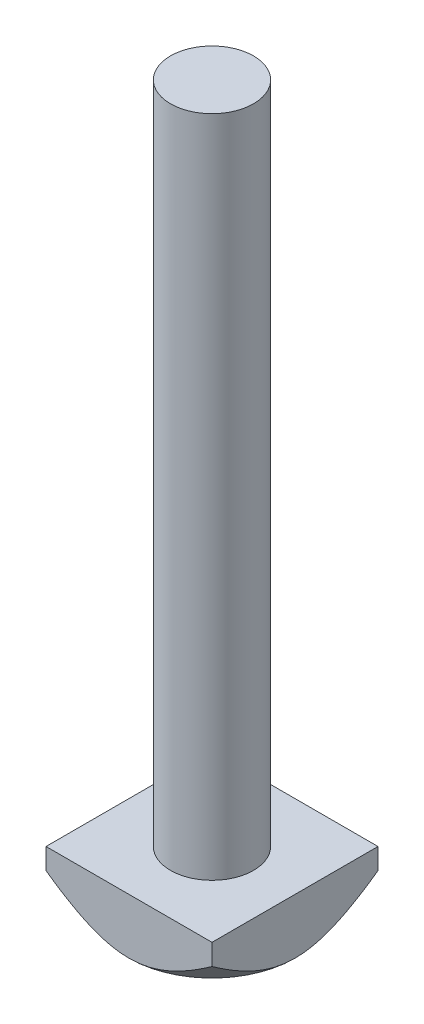
ISO-10303-21;
HEADER;
FILE_DESCRIPTION(('STEP AP214'),'2;1');
FILE_NAME('part.step','',(''),(''),'','','');
FILE_SCHEMA(('AUTOMOTIVE_DESIGN { 1 0 10303 214 1 1 1 1 }'));
ENDSEC;
DATA;
#1=APPLICATION_CONTEXT('core data for automotive mechanical design processes');
#2=APPLICATION_PROTOCOL_DEFINITION('international standard','automotive_design',2000,#1);
#3=PRODUCT_CONTEXT('',#1,'mechanical');
#4=PRODUCT('Part','Part','',(#3));
#5=PRODUCT_RELATED_PRODUCT_CATEGORY('part','',(#4));
#6=PRODUCT_DEFINITION_FORMATION('','',#4);
#7=PRODUCT_DEFINITION_CONTEXT('part definition',#1,'design');
#8=PRODUCT_DEFINITION('design','',#6,#7);
#9=PRODUCT_DEFINITION_SHAPE('','',#8);
#10=(LENGTH_UNIT() NAMED_UNIT(*) SI_UNIT(.MILLI.,.METRE.));
#11=(NAMED_UNIT(*) PLANE_ANGLE_UNIT() SI_UNIT($,.RADIAN.));
#12=(NAMED_UNIT(*) SI_UNIT($,.STERADIAN.) SOLID_ANGLE_UNIT());
#13=UNCERTAINTY_MEASURE_WITH_UNIT(LENGTH_MEASURE(1.E-05),#10,'distance_accuracy_value','');
#14=(GEOMETRIC_REPRESENTATION_CONTEXT(3) GLOBAL_UNCERTAINTY_ASSIGNED_CONTEXT((#13)) GLOBAL_UNIT_ASSIGNED_CONTEXT((#10,
#11,#12)) REPRESENTATION_CONTEXT('',''));
#15=CARTESIAN_POINT('',(0.,0.,0.));
#16=DIRECTION('',(0.,0.,1.));
#17=DIRECTION('',(1.,0.,0.));
#18=AXIS2_PLACEMENT_3D('',#15,#16,#17);
#19=CARTESIAN_POINT('',(12.,-8.,12.));
#20=DIRECTION('',(-1.,0.,0.));
#21=DIRECTION('',(0.,0.,1.));
#22=AXIS2_PLACEMENT_3D('',#19,#20,#21);
#23=PLANE('',#22);
#24=CARTESIAN_POINT('',(12.,5.3689102100647,-22.3513222259071));
#25=CARTESIAN_POINT('',(12.,5.13736190047693,-22.088509990144));
#26=CARTESIAN_POINT('',(12.,4.90632458831332,-21.8252476314892));
#27=CARTESIAN_POINT('',(12.,4.44538397632067,-21.2977292862648));
#28=CARTESIAN_POINT('',(12.,4.21548068351561,-21.0334732935586));
#29=CARTESIAN_POINT('',(12.,3.52758801479437,-20.2390148414806));
#30=CARTESIAN_POINT('',(12.,3.07147259656893,-19.7071862102684));
#31=CARTESIAN_POINT('',(12.,2.16300388197894,-18.6354514814754));
#32=CARTESIAN_POINT('',(12.,1.71068344601451,-18.0955174815937));
#33=CARTESIAN_POINT('',(12.,0.813910678205558,-17.0091988035968));
#34=CARTESIAN_POINT('',(12.,0.369457888366016,-16.4628145040764));
#35=CARTESIAN_POINT('',(12.,-0.539030844566958,-15.3249734951729));
#36=CARTESIAN_POINT('',(12.,-1.00237131819129,-14.7329584003529));
#37=CARTESIAN_POINT('',(12.,-1.68600808585,-13.8361666655542));
#38=CARTESIAN_POINT('',(12.,-1.91201553101741,-13.5357411189534));
#39=CARTESIAN_POINT('',(12.,-2.35957015535307,-12.9315894862268));
#40=CARTESIAN_POINT('',(12.,-2.58111743055364,-12.6278634713809));
#41=CARTESIAN_POINT('',(12.,-3.01850563384191,-12.0173375536681));
#42=CARTESIAN_POINT('',(12.,-3.23435807425068,-11.7105459119757));
#43=CARTESIAN_POINT('',(12.,-3.65990939006863,-11.0927329470836));
#44=CARTESIAN_POINT('',(12.,-3.86960852187895,-10.7817118009149));
#45=CARTESIAN_POINT('',(12.,-4.28162337559137,-10.1549553085208));
#46=CARTESIAN_POINT('',(12.,-4.48394155122225,-9.83922157905307));
#47=CARTESIAN_POINT('',(12.,-4.87980246976277,-9.20231670987964));
#48=CARTESIAN_POINT('',(12.,-5.07334606487023,-8.88114610238907));
#49=CARTESIAN_POINT('',(12.,-5.39006944724618,-8.33561578258767));
#50=CARTESIAN_POINT('',(12.,-5.51607766239494,-8.1128980354321));
#51=CARTESIAN_POINT('',(12.,-5.76246741828219,-7.66436321882493));
#52=CARTESIAN_POINT('',(12.,-5.88284894058031,-7.43854613921901));
#53=CARTESIAN_POINT('',(12.,-6.11722771628169,-6.98351013679224));
#54=CARTESIAN_POINT('',(12.,-6.23122275197839,-6.75429006680912));
#55=CARTESIAN_POINT('',(12.,-6.45184807681314,-6.29234242382478));
#56=CARTESIAN_POINT('',(12.,-6.55847840426251,-6.05961486907723));
#57=CARTESIAN_POINT('',(12.,-6.86374326600022,-5.36059801397737));
#58=CARTESIAN_POINT('',(12.,-7.05017439942296,-4.88885318499952));
#59=CARTESIAN_POINT('',(12.,-7.38060839285397,-3.93071990124417));
#60=CARTESIAN_POINT('',(12.,-7.52463729261794,-3.44434063681217));
#61=CARTESIAN_POINT('',(12.,-7.7259227551205,-2.60164355427477));
#62=CARTESIAN_POINT('',(12.,-7.79622909409987,-2.24844924440334));
#63=CARTESIAN_POINT('',(12.,-7.90700999848045,-1.53739156756148));
#64=CARTESIAN_POINT('',(12.,-7.94749002965271,-1.17952906829119));
#65=CARTESIAN_POINT('',(12.,-7.99642308557863,-0.462212905030138));
#66=CARTESIAN_POINT('',(12.,-8.00493133286827,-0.102763059209487));
#67=CARTESIAN_POINT('',(12.,-7.98959311683888,0.615458287439698));
#68=CARTESIAN_POINT('',(12.,-7.96574483517115,0.974229749010229));
#69=CARTESIAN_POINT('',(12.,-7.88721612346468,1.68650260743028));
#70=CARTESIAN_POINT('',(12.,-7.83269046192834,2.04002138594238));
#71=CARTESIAN_POINT('',(12.,-7.69560733458785,2.74163196707585));
#72=CARTESIAN_POINT('',(12.,-7.61304251398521,3.0897223207149));
#73=CARTESIAN_POINT('',(12.,-7.47064540967607,3.60727321921916));
#74=CARTESIAN_POINT('',(12.,-7.41998081941611,3.77932945191414));
#75=CARTESIAN_POINT('',(12.,-7.31294888158692,4.12160982810903));
#76=CARTESIAN_POINT('',(12.,-7.25658322335147,4.29183449789033));
#77=CARTESIAN_POINT('',(12.,-7.13859211225057,4.63044358372392));
#78=CARTESIAN_POINT('',(12.,-7.076966689944,4.7988280104615));
#79=CARTESIAN_POINT('',(12.,-6.94888594663187,5.13376134245805));
#80=CARTESIAN_POINT('',(12.,-6.88243012401625,5.30031005501432));
#81=CARTESIAN_POINT('',(12.,-6.60892685017616,5.96014535450085));
#82=CARTESIAN_POINT('',(12.,-6.38446819659669,6.44627669568727));
#83=CARTESIAN_POINT('',(12.,-5.90589729621872,7.40377184992624));
#84=CARTESIAN_POINT('',(12.,-5.65176712910875,7.87512651825909));
#85=CARTESIAN_POINT('',(12.,-5.1204920454972,8.80602554421316));
#86=CARTESIAN_POINT('',(12.,-4.84329584347841,9.26554043908967));
#87=CARTESIAN_POINT('',(12.,-4.27177015179178,10.1735734430661));
#88=CARTESIAN_POINT('',(12.,-3.97744422360786,10.6220938107005));
#89=CARTESIAN_POINT('',(12.,-3.37127995924887,11.5162401733042));
#90=CARTESIAN_POINT('',(12.,-3.05925491218225,11.9617390221694));
#91=CARTESIAN_POINT('',(12.,-2.42445158665774,12.8450043568881));
#92=CARTESIAN_POINT('',(12.,-2.10167288061558,13.2827705342155));
#93=CARTESIAN_POINT('',(12.,-1.44802509077842,14.1512324219697));
#94=CARTESIAN_POINT('',(12.,-1.11716814233741,14.5819372872676));
#95=CARTESIAN_POINT('',(12.,-0.615717168374387,15.2239355102751));
#96=CARTESIAN_POINT('',(12.,-0.44770786746039,15.4372559915235));
#97=CARTESIAN_POINT('',(12.,-0.110125553361552,15.8626562201758));
#98=CARTESIAN_POINT('',(12.,0.0594474591073463,16.0747359681476));
#99=CARTESIAN_POINT('',(12.,0.56928442773025,16.7080260778468));
#100=CARTESIAN_POINT('',(12.,0.91165115754833,17.1275445845484));
#101=CARTESIAN_POINT('',(12.,1.60103578864211,17.962746827521));
#102=CARTESIAN_POINT('',(12.,1.94805377057679,18.3784304970791));
#103=CARTESIAN_POINT('',(12.,2.64600320752693,19.2065388115467));
#104=CARTESIAN_POINT('',(12.,2.99693489254479,19.6189632624572));
#105=CARTESIAN_POINT('',(12.,3.70209578009602,20.4409851369525));
#106=CARTESIAN_POINT('',(12.,4.05632500521042,20.8505825411446));
#107=CARTESIAN_POINT('',(12.,5.12338328291958,22.0759199323687));
#108=CARTESIAN_POINT('',(12.,5.84041207363196,22.8880033733083));
#109=CARTESIAN_POINT('',(12.,7.28274771056997,24.5047186996569));
#110=CARTESIAN_POINT('',(12.,8.00805430066829,25.3093508142329));
#111=CARTESIAN_POINT('',(12.,9.46612998110934,26.9140334017498));
#112=CARTESIAN_POINT('',(12.,10.1989086656997,27.7140751488167));
#113=CARTESIAN_POINT('',(12.,11.6694600007363,29.3095606651683));
#114=CARTESIAN_POINT('',(12.,12.4072326848842,30.1050044033565));
#115=CARTESIAN_POINT('',(12.,13.8866449935437,31.6920684877791));
#116=CARTESIAN_POINT('',(12.,14.6282840383306,32.4836893747673));
#117=CARTESIAN_POINT('',(12.,16.1147813822077,34.0638973966214));
#118=CARTESIAN_POINT('',(12.,16.8596396737237,34.8524845386168));
#119=CARTESIAN_POINT('',(12.,18.9568814808609,37.0654350804605));
#120=CARTESIAN_POINT('',(12.,20.3122608799398,38.4869589132532));
#121=CARTESIAN_POINT('',(12.,23.0292681012647,41.3241333793044));
#122=CARTESIAN_POINT('',(12.,24.3908961934966,42.7397837536606));
#123=CARTESIAN_POINT('',(12.,27.1154253620401,45.5631430701065));
#124=CARTESIAN_POINT('',(12.,28.4783150769223,46.9708629799253));
#125=CARTESIAN_POINT('',(12.,30.5252599963346,49.0798365755662));
#126=CARTESIAN_POINT('',(12.,31.2079923122359,49.7823752354487));
#127=CARTESIAN_POINT('',(12.,32.5742409321117,51.1866890227903));
#128=CARTESIAN_POINT('',(12.,33.2577572356099,51.8884641507127));
#129=CARTESIAN_POINT('',(12.,33.9416170397079,52.5899044385756));
#130=B_SPLINE_CURVE_WITH_KNOTS('',3,(#24,#25,#26,#27,#28,#29,#30,#31,#32,#33,#34,#35,#36,#37,
#38,#39,#40,#41,#42,#43,#44,#45,#46,#47,#48,#49,#50,#51,#52,#53,#54,#55,#56,#57,#58,#59,#60,#61,
#62,#63,#64,#65,#66,#67,#68,#69,#70,#71,#72,#73,#74,#75,#76,#77,#78,#79,#80,#81,#82,#83,#84,#85,
#86,#87,#88,#89,#90,#91,#92,#93,#94,#95,#96,#97,#98,#99,#100,#101,#102,#103,#104,#105,#106,#107,
#108,#109,#110,#111,#112,#113,#114,#115,#116,#117,#118,#119,#120,#121,#122,#123,#124,#125,#126,
#127,#128,#129),.UNSPECIFIED.,.F.,.F.,(4,2,2,2,2,2,2,2,2,2,2,2,2,2,2,2,2,2,2,2,2,2,2,2,2,2,2,2,
2,2,2,2,2,2,2,2,2,2,2,2,2,2,2,2,2,2,2,2,2,2,2,2,4),(0.,1.05079095052554,2.1015884013653,
4.20344057923664,6.31645917375515,8.42935435706648,10.6844662924936,11.8122698386953,
12.9400490760328,14.0653398921954,15.1905837520365,16.3154500617174,17.4402068879619,
18.2078175214335,18.9754306704206,19.7433087415357,20.5111828178378,22.0313092709581,
23.5505002382267,24.6297578546531,25.7088176442741,26.7860127934818,27.8632684806268,
28.9351374887623,30.0072878704371,30.5452895581387,31.0831322902778,31.6209718977974,
32.1588674369663,33.7636656373625,35.3694381295268,36.9788815522628,38.5879915388013,
40.2194949229904,41.85106325621,43.4803154568018,44.2949229440627,45.1095300583755,
46.7339534700335,48.3584050879236,49.9829526807915,51.6075114065044,54.8574218693503,
58.1072320463428,61.3619368954095,64.6166637305737,67.8709158340192,71.1251602851997,
77.0175028128228,82.9101023727212,88.7882136342705,91.7271170465345,94.6660186738701),.UNSPECIFIED.);
#131=CARTESIAN_POINT('',(12.,-3.02943725152288,-12.));
#132=VERTEX_POINT('',#131);
#133=CARTESIAN_POINT('',(12.,-8.,0.));
#134=VERTEX_POINT('',#133);
#135=EDGE_CURVE('E90',#132,#134,#130,.T.);
#136=ORIENTED_EDGE('',*,*,#135,.F.);
#137=DIRECTION('',(0.,1.,0.));
#138=VECTOR('',#137,1.);
#139=CARTESIAN_POINT('',(12.,-8.,-12.));
#140=LINE('',#139,#138);
#141=CARTESIAN_POINT('',(12.,0.,-12.));
#142=VERTEX_POINT('',#141);
#143=EDGE_CURVE('E57',#132,#142,#140,.T.);
#144=ORIENTED_EDGE('',*,*,#143,.T.);
#145=DIRECTION('',(0.,0.,1.));
#146=VECTOR('',#145,1.);
#147=CARTESIAN_POINT('',(12.,0.,12.));
#148=LINE('',#147,#146);
#149=CARTESIAN_POINT('',(12.,0.,12.));
#150=VERTEX_POINT('',#149);
#151=EDGE_CURVE('E97',#142,#150,#148,.T.);
#152=ORIENTED_EDGE('',*,*,#151,.T.);
#153=DIRECTION('',(0.,1.,0.));
#154=VECTOR('',#153,1.);
#155=CARTESIAN_POINT('',(12.,-8.,12.));
#156=LINE('',#155,#154);
#157=CARTESIAN_POINT('',(12.,-3.02943725152288,12.));
#158=VERTEX_POINT('',#157);
#159=EDGE_CURVE('E109',#158,#150,#156,.T.);
#160=ORIENTED_EDGE('',*,*,#159,.F.);
#161=EDGE_CURVE('E98',#134,#158,#130,.T.);
#162=ORIENTED_EDGE('',*,*,#161,.F.);
#163=EDGE_LOOP('',(#136,#144,#152,#160,#162));
#164=FACE_BOUND('',#163,.T.);
#165=ADVANCED_FACE('F34',(#164),#23,.F.);
#166=CARTESIAN_POINT('',(-12.,-8.,12.));
#167=DIRECTION('',(0.,0.,-1.));
#168=DIRECTION('',(-1.,0.,0.));
#169=AXIS2_PLACEMENT_3D('',#166,#167,#168);
#170=PLANE('',#169);
#171=CARTESIAN_POINT('',(-22.3513222188613,5.36891020385704,12.));
#172=CARTESIAN_POINT('',(-22.0885099831906,5.13736189436699,12.));
#173=CARTESIAN_POINT('',(-21.8252476246282,4.90632458230114,12.));
#174=CARTESIAN_POINT('',(-21.2977292795885,4.4453839705041,12.));
#175=CARTESIAN_POINT('',(-21.0334732869747,4.21548067779689,12.));
#176=CARTESIAN_POINT('',(-20.2390148351737,3.52758800936936,12.));
#177=CARTESIAN_POINT('',(-19.7071862041462,3.07147259133991,12.));
#178=CARTESIAN_POINT('',(-18.6354514757239,2.16300387714334,12.));
#179=CARTESIAN_POINT('',(-18.0955174760282,1.71068344137634,12.));
#180=CARTESIAN_POINT('',(-17.0091987984038,0.813910673962382,12.));
#181=CARTESIAN_POINT('',(-16.4628144990698,0.369457884320416,12.));
#182=CARTESIAN_POINT('',(-15.3249734906042,-0.53903084816317,12.));
#183=CARTESIAN_POINT('',(-14.7329583960364,-1.00237132153669,12.));
#184=CARTESIAN_POINT('',(-13.8361666616195,-1.68600808882209,12.));
#185=CARTESIAN_POINT('',(-13.5357411151466,-1.91201553386552,12.));
#186=CARTESIAN_POINT('',(-12.9315894826771,-2.35957015795459,12.));
#187=CARTESIAN_POINT('',(-12.6278634679604,-2.58111743303253,12.));
#188=CARTESIAN_POINT('',(-12.0173375505077,-3.01850563607773,12.));
#189=CARTESIAN_POINT('',(-11.710545908946,-3.23435807636603,12.));
#190=CARTESIAN_POINT('',(-11.0927329443175,-3.65990939194554,12.));
#191=CARTESIAN_POINT('',(-10.7817117982817,-3.86960852363788,12.));
#192=CARTESIAN_POINT('',(-10.1549553061564,-4.2816233771178,12.));
#193=CARTESIAN_POINT('',(-9.83922157682436,-4.48394155263415,12.));
#194=CARTESIAN_POINT('',(-9.2023167079261,-4.87980247095029,12.));
#195=CARTESIAN_POINT('',(-8.88114610057492,-5.07334606594789,12.));
#196=CARTESIAN_POINT('',(-8.33561578104241,-5.39006944812669,12.));
#197=CARTESIAN_POINT('',(-8.11289803401553,-5.51607766318712,12.));
#198=CARTESIAN_POINT('',(-7.66436321766907,-5.7624674189031,12.));
#199=CARTESIAN_POINT('',(-7.43854613819518,-5.88284894111829,12.));
#200=CARTESIAN_POINT('',(-6.9835101360364,-6.11722771666038,12.));
#201=CARTESIAN_POINT('',(-6.75429006618925,-6.23122275228072,12.));
#202=CARTESIAN_POINT('',(-6.29234242348099,-6.45184807697105,12.));
#203=CARTESIAN_POINT('',(-6.05961486887353,-6.55847840435235,12.));
#204=CARTESIAN_POINT('',(-5.36059801418857,-6.86374326590624,12.));
#205=CARTESIAN_POINT('',(-4.88885318549191,-7.0501743992272,12.));
#206=CARTESIAN_POINT('',(-3.93071990231565,-7.38060839251031,12.));
#207=CARTESIAN_POINT('',(-3.44434063818151,-7.52463729222803,12.));
#208=CARTESIAN_POINT('',(-2.60164355597176,-7.72592275475981,12.));
#209=CARTESIAN_POINT('',(-2.24844924612405,-7.79622909378198,12.));
#210=CARTESIAN_POINT('',(-1.53739156932652,-7.9070099982552,12.));
#211=CARTESIAN_POINT('',(-1.17952907007685,-7.94749002947731,12.));
#212=CARTESIAN_POINT('',(-0.462212906853653,-7.99642308550772,12.));
#213=CARTESIAN_POINT('',(-0.102763061050242,-8.00493133285211,12.));
#214=CARTESIAN_POINT('',(0.615458285569525,-7.9895931169343,12.));
#215=CARTESIAN_POINT('',(0.974229747127879,-7.96574483532343,12.));
#216=CARTESIAN_POINT('',(1.68650260553244,-7.88721612372893,12.));
#217=CARTESIAN_POINT('',(2.04002138404117,-7.83269046224736,12.));
#218=CARTESIAN_POINT('',(2.74163196517132,-7.69560733501246,12.));
#219=CARTESIAN_POINT('',(3.08972231881041,-7.61304251446064,12.));
#220=CARTESIAN_POINT('',(3.60727321731633,-7.47064541022401,12.));
#221=CARTESIAN_POINT('',(3.77932945001214,-7.41998081998762,12.));
#222=CARTESIAN_POINT('',(4.12160982620907,-7.31294888220426,12.));
#223=CARTESIAN_POINT('',(4.29183449599157,-7.25658322399107,12.));
#224=CARTESIAN_POINT('',(4.63044358182781,-7.13859211293333,12.));
#225=CARTESIAN_POINT('',(4.79882800856684,-7.07696669064768,12.));
#226=CARTESIAN_POINT('',(5.13376134056641,-6.94888594737609,12.));
#227=CARTESIAN_POINT('',(5.30031005312423,-6.88243012478009,12.));
#228=CARTESIAN_POINT('',(5.96014535238347,-6.60892685111245,12.));
#229=CARTESIAN_POINT('',(6.44627669334868,-6.38446819769937,12.));
#230=CARTESIAN_POINT('',(7.40377184715675,-5.90589729766919,12.));
#231=CARTESIAN_POINT('',(7.87512651527994,-5.65176713074064,12.));
#232=CARTESIAN_POINT('',(8.80602554082183,-5.12049204750113,12.));
#233=CARTESIAN_POINT('',(9.26554043549587,-4.843295845673,12.));
#234=CARTESIAN_POINT('',(10.1735734390731,-4.27177015437235,12.));
#235=CARTESIAN_POINT('',(10.6220938065107,-3.97744422638374,12.));
#236=CARTESIAN_POINT('',(11.5162401687229,-3.37127996241997,12.));
#237=CARTESIAN_POINT('',(11.9617390173934,-3.05925491555327,12.));
#238=CARTESIAN_POINT('',(12.845004351725,-2.42445159042991,12.));
#239=CARTESIAN_POINT('',(13.2827705288601,-2.10167288458898,12.));
#240=CARTESIAN_POINT('',(14.1512324162318,-1.4480250951543,12.));
#241=CARTESIAN_POINT('',(14.5819372813395,-1.11716814691452,12.));
#242=CARTESIAN_POINT('',(15.2239355040625,-0.615717173253445,12.));
#243=CARTESIAN_POINT('',(15.4372559852162,-0.447707872440111,12.));
#244=CARTESIAN_POINT('',(15.8626562136792,-0.110125558542603,12.));
#245=CARTESIAN_POINT('',(16.0747359615565,0.0594474538256294,12.));
#246=CARTESIAN_POINT('',(16.7080260712021,0.569284422331835,12.));
#247=CARTESIAN_POINT('',(17.1275445779426,0.911651152136979,12.));
#248=CARTESIAN_POINT('',(17.9627468209894,1.60103578320971,12.));
#249=CARTESIAN_POINT('',(18.3784304905828,1.94805376513627,12.));
#250=CARTESIAN_POINT('',(19.2065388051182,2.64600320207403,12.));
#251=CARTESIAN_POINT('',(19.6189632560612,2.99693488708764,12.));
#252=CARTESIAN_POINT('',(20.4409851306191,3.70209577463338,12.));
#253=CARTESIAN_POINT('',(20.8505825348412,4.05632499974657,12.));
#254=CARTESIAN_POINT('',(22.0759199261532,5.12338327745607,12.));
#255=CARTESIAN_POINT('',(22.8880033671476,5.84041206817369,12.));
#256=CARTESIAN_POINT('',(24.5047186936001,7.28274770512862,12.));
#257=CARTESIAN_POINT('',(25.3093508082254,8.00805429523864,12.));
#258=CARTESIAN_POINT('',(26.9140333958381,9.46612997570866,12.));
#259=CARTESIAN_POINT('',(27.7140751429514,10.1989086603163,12.));
#260=CARTESIAN_POINT('',(29.3095606593932,11.6694599953908,12.));
#261=CARTESIAN_POINT('',(30.105004397625,12.4072326795592,12.));
#262=CARTESIAN_POINT('',(31.6920684821324,13.8866449882621,12.));
#263=CARTESIAN_POINT('',(32.4836893691618,14.6282840330719,12.));
#264=CARTESIAN_POINT('',(34.0638973910967,16.1147813769963,12.));
#265=CARTESIAN_POINT('',(34.8524845331316,16.8596396685369,12.));
#266=CARTESIAN_POINT('',(37.0654350749739,18.9568814756402,12.));
#267=CARTESIAN_POINT('',(38.4869589077249,20.3122608746614,12.));
#268=CARTESIAN_POINT('',(41.3241333736907,23.0292680958731,12.));
#269=CARTESIAN_POINT('',(42.7397837480034,24.3908961880496,12.));
#270=CARTESIAN_POINT('',(45.5631430643572,27.1154253564799,12.));
#271=CARTESIAN_POINT('',(46.9708629741273,28.4783150713045,12.));
#272=CARTESIAN_POINT('',(49.0798365696945,30.5252599906309,12.));
#273=CARTESIAN_POINT('',(49.7823752295523,31.2079923065036,12.));
#274=CARTESIAN_POINT('',(51.1866890168442,32.5742409263225,12.));
#275=CARTESIAN_POINT('',(51.8884641447417,33.2577572297923,12.));
#276=CARTESIAN_POINT('',(52.5899044325796,33.941617033862,12.));
#277=B_SPLINE_CURVE_WITH_KNOTS('',3,(#171,#172,#173,#174,#175,#176,#177,#178,#179,#180,#181,
#182,#183,#184,#185,#186,#187,#188,#189,#190,#191,#192,#193,#194,#195,#196,#197,#198,#199,#200,
#201,#202,#203,#204,#205,#206,#207,#208,#209,#210,#211,#212,#213,#214,#215,#216,#217,#218,#219,
#220,#221,#222,#223,#224,#225,#226,#227,#228,#229,#230,#231,#232,#233,#234,#235,#236,#237,#238,
#239,#240,#241,#242,#243,#244,#245,#246,#247,#248,#249,#250,#251,#252,#253,#254,#255,#256,#257,
#258,#259,#260,#261,#262,#263,#264,#265,#266,#267,#268,#269,#270,#271,#272,#273,#274,#275,#276),
.UNSPECIFIED.,.F.,.F.,(4,2,2,2,2,2,2,2,2,2,2,2,2,2,2,2,2,2,2,2,2,2,2,2,2,2,2,2,2,2,2,2,2,2,2,2,
2,2,2,2,2,2,2,2,2,2,2,2,2,2,2,2,4),(0.,1.05079095012384,2.10158840056191,4.20344057762981,
6.31645917134025,8.42935435384357,10.6844662882109,11.8122698338826,12.94004907069,
14.0653398863241,15.1905837456366,16.3154500547892,17.4402068805056,18.2078175135108,
18.9754306620315,19.7433087326796,20.5111828085146,22.0313092607411,23.5505002271192,
24.6297578435013,25.7088176330781,26.7860127822382,27.8632684693354,28.9351374774357,
30.0072878590751,30.5452895467591,31.0831322788806,31.6209718863827,32.158867425534,
33.7636656251198,35.3694381164724,36.9788815383929,38.5879915241165,40.219494907483,
41.85106323988,43.4803154396515,44.2949229265023,45.1095300404049,46.7339534521286,
48.3584050700844,49.9829526630182,51.607511388797,54.8574218517763,58.107232028902,
61.3619368781065,64.6166637134086,67.8709158169911,71.1251602683085,77.0175027957216,
82.9101023554105,88.7882136167345,91.7271170288856,94.6660186561083),.UNSPECIFIED.);
#278=CARTESIAN_POINT('',(0.,-8.,12.));
#279=VERTEX_POINT('',#278);
#280=EDGE_CURVE('E103',#158,#279,#277,.F.);
#281=ORIENTED_EDGE('',*,*,#280,.F.);
#282=ORIENTED_EDGE('',*,*,#159,.T.);
#283=DIRECTION('',(-1.,0.,0.));
#284=VECTOR('',#283,1.);
#285=CARTESIAN_POINT('',(-12.,0.,12.));
#286=LINE('',#285,#284);
#287=CARTESIAN_POINT('',(-12.,0.,12.));
#288=VERTEX_POINT('',#287);
#289=EDGE_CURVE('E198',#150,#288,#286,.T.);
#290=ORIENTED_EDGE('',*,*,#289,.T.);
#291=DIRECTION('',(0.,1.,0.));
#292=VECTOR('',#291,1.);
#293=CARTESIAN_POINT('',(-12.,-8.,12.));
#294=LINE('',#293,#292);
#295=CARTESIAN_POINT('',(-12.,-3.02943725152288,12.));
#296=VERTEX_POINT('',#295);
#297=EDGE_CURVE('E161',#296,#288,#294,.T.);
#298=ORIENTED_EDGE('',*,*,#297,.F.);
#299=EDGE_CURVE('E110',#279,#296,#277,.F.);
#300=ORIENTED_EDGE('',*,*,#299,.F.);
#301=EDGE_LOOP('',(#281,#282,#290,#298,#300));
#302=FACE_BOUND('',#301,.T.);
#303=ADVANCED_FACE('F149',(#302),#170,.F.);
#304=CARTESIAN_POINT('',(-12.,-8.,12.));
#305=DIRECTION('',(1.,0.,0.));
#306=DIRECTION('',(0.,0.,-1.));
#307=AXIS2_PLACEMENT_3D('',#304,#305,#306);
#308=PLANE('',#307);
#309=CARTESIAN_POINT('',(-12.,5.36891020385704,-22.3513222188613));
#310=CARTESIAN_POINT('',(-12.,5.13736189436698,-22.0885099831906));
#311=CARTESIAN_POINT('',(-12.,4.90632458230113,-21.8252476246282));
#312=CARTESIAN_POINT('',(-12.,4.4453839705041,-21.2977292795885));
#313=CARTESIAN_POINT('',(-12.,4.21548067779688,-21.0334732869747));
#314=CARTESIAN_POINT('',(-12.,3.52758800936935,-20.2390148351737));
#315=CARTESIAN_POINT('',(-12.,3.0714725913399,-19.7071862041462));
#316=CARTESIAN_POINT('',(-12.,2.16300387714333,-18.6354514757239));
#317=CARTESIAN_POINT('',(-12.,1.71068344137633,-18.0955174760282));
#318=CARTESIAN_POINT('',(-12.,0.813910673962377,-17.0091987984038));
#319=CARTESIAN_POINT('',(-12.,0.369457884320409,-16.4628144990698));
#320=CARTESIAN_POINT('',(-12.,-0.539030848163179,-15.3249734906042));
#321=CARTESIAN_POINT('',(-12.,-1.0023713215367,-14.7329583960364));
#322=CARTESIAN_POINT('',(-12.,-1.6860080888221,-13.8361666616195));
#323=CARTESIAN_POINT('',(-12.,-1.91201553386553,-13.5357411151466));
#324=CARTESIAN_POINT('',(-12.,-2.35957015795459,-12.9315894826771));
#325=CARTESIAN_POINT('',(-12.,-2.58111743303254,-12.6278634679604));
#326=CARTESIAN_POINT('',(-12.,-3.01850563607773,-12.0173375505077));
#327=CARTESIAN_POINT('',(-12.,-3.23435807636603,-11.710545908946));
#328=CARTESIAN_POINT('',(-12.,-3.65990939194554,-11.0927329443175));
#329=CARTESIAN_POINT('',(-12.,-3.86960852363788,-10.7817117982817));
#330=CARTESIAN_POINT('',(-12.,-4.2816233771178,-10.1549553061564));
#331=CARTESIAN_POINT('',(-12.,-4.48394155263416,-9.83922157682436));
#332=CARTESIAN_POINT('',(-12.,-4.87980247095029,-9.2023167079261));
#333=CARTESIAN_POINT('',(-12.,-5.07334606594789,-8.88114610057492));
#334=CARTESIAN_POINT('',(-12.,-5.3900694481267,-8.3356157810424));
#335=CARTESIAN_POINT('',(-12.,-5.51607766318712,-8.11289803401552));
#336=CARTESIAN_POINT('',(-12.,-5.76246741890311,-7.66436321766906));
#337=CARTESIAN_POINT('',(-12.,-5.8828489411183,-7.43854613819518));
#338=CARTESIAN_POINT('',(-12.,-6.11722771666038,-6.98351013603639));
#339=CARTESIAN_POINT('',(-12.,-6.23122275228073,-6.75429006618925));
#340=CARTESIAN_POINT('',(-12.,-6.45184807697106,-6.29234242348099));
#341=CARTESIAN_POINT('',(-12.,-6.55847840435236,-6.05961486887353));
#342=CARTESIAN_POINT('',(-12.,-6.86374326590624,-5.36059801418857));
#343=CARTESIAN_POINT('',(-12.,-7.0501743992272,-4.88885318549191));
#344=CARTESIAN_POINT('',(-12.,-7.38060839251031,-3.93071990231565));
#345=CARTESIAN_POINT('',(-12.,-7.52463729222804,-3.44434063818151));
#346=CARTESIAN_POINT('',(-12.,-7.72592275475982,-2.60164355597176));
#347=CARTESIAN_POINT('',(-12.,-7.79622909378199,-2.24844924612404));
#348=CARTESIAN_POINT('',(-12.,-7.9070099982552,-1.53739156932651));
#349=CARTESIAN_POINT('',(-12.,-7.94749002947731,-1.17952907007685));
#350=CARTESIAN_POINT('',(-12.,-7.99642308550772,-0.462212906853652));
#351=CARTESIAN_POINT('',(-12.,-8.00493133285211,-0.102763061050243));
#352=CARTESIAN_POINT('',(-12.,-7.9895931169343,0.615458285569523));
#353=CARTESIAN_POINT('',(-12.,-7.96574483532343,0.974229747127878));
#354=CARTESIAN_POINT('',(-12.,-7.88721612372893,1.68650260553244));
#355=CARTESIAN_POINT('',(-12.,-7.83269046224736,2.04002138404117));
#356=CARTESIAN_POINT('',(-12.,-7.69560733501246,2.74163196517132));
#357=CARTESIAN_POINT('',(-12.,-7.61304251446065,3.08972231881041));
#358=CARTESIAN_POINT('',(-12.,-7.47064541022401,3.60727321731633));
#359=CARTESIAN_POINT('',(-12.,-7.41998081998762,3.77932945001214));
#360=CARTESIAN_POINT('',(-12.,-7.31294888220426,4.12160982620907));
#361=CARTESIAN_POINT('',(-12.,-7.25658322399107,4.29183449599157));
#362=CARTESIAN_POINT('',(-12.,-7.13859211293333,4.63044358182781));
#363=CARTESIAN_POINT('',(-12.,-7.07696669064768,4.79882800856684));
#364=CARTESIAN_POINT('',(-12.,-6.94888594737609,5.13376134056641));
#365=CARTESIAN_POINT('',(-12.,-6.88243012478009,5.30031005312423));
#366=CARTESIAN_POINT('',(-12.,-6.60892685111245,5.96014535238347));
#367=CARTESIAN_POINT('',(-12.,-6.38446819769938,6.44627669334868));
#368=CARTESIAN_POINT('',(-12.,-5.9058972976692,7.40377184715675));
#369=CARTESIAN_POINT('',(-12.,-5.65176713074065,7.87512651527994));
#370=CARTESIAN_POINT('',(-12.,-5.12049204750113,8.80602554082183));
#371=CARTESIAN_POINT('',(-12.,-4.84329584567301,9.26554043549586));
#372=CARTESIAN_POINT('',(-12.,-4.27177015437236,10.1735734390731));
#373=CARTESIAN_POINT('',(-12.,-3.97744422638375,10.6220938065107));
#374=CARTESIAN_POINT('',(-12.,-3.37127996241997,11.5162401687229));
#375=CARTESIAN_POINT('',(-12.,-3.05925491555327,11.9617390173934));
#376=CARTESIAN_POINT('',(-12.,-2.42445159042992,12.845004351725));
#377=CARTESIAN_POINT('',(-12.,-2.10167288458899,13.2827705288601));
#378=CARTESIAN_POINT('',(-12.,-1.4480250951543,14.1512324162318));
#379=CARTESIAN_POINT('',(-12.,-1.11716814691452,14.5819372813395));
#380=CARTESIAN_POINT('',(-12.,-0.615717173253446,15.2239355040625));
#381=CARTESIAN_POINT('',(-12.,-0.447707872440113,15.4372559852162));
#382=CARTESIAN_POINT('',(-12.,-0.110125558542604,15.8626562136792));
#383=CARTESIAN_POINT('',(-12.,0.0594474538256287,16.0747359615565));
#384=CARTESIAN_POINT('',(-12.,0.569284422331836,16.7080260712021));
#385=CARTESIAN_POINT('',(-12.,0.91165115213698,17.1275445779426));
#386=CARTESIAN_POINT('',(-12.,1.60103578320971,17.9627468209894));
#387=CARTESIAN_POINT('',(-12.,1.94805376513627,18.3784304905828));
#388=CARTESIAN_POINT('',(-12.,2.64600320207403,19.2065388051182));
#389=CARTESIAN_POINT('',(-12.,2.99693488708764,19.6189632560612));
#390=CARTESIAN_POINT('',(-12.,3.70209577463338,20.440985130619));
#391=CARTESIAN_POINT('',(-12.,4.05632499974656,20.8505825348412));
#392=CARTESIAN_POINT('',(-12.,5.12338327745607,22.0759199261532));
#393=CARTESIAN_POINT('',(-12.,5.84041206817368,22.8880033671476));
#394=CARTESIAN_POINT('',(-12.,7.28274770512862,24.5047186936001));
#395=CARTESIAN_POINT('',(-12.,8.00805429523864,25.3093508082254));
#396=CARTESIAN_POINT('',(-12.,9.46612997570866,26.9140333958381));
#397=CARTESIAN_POINT('',(-12.,10.1989086603163,27.7140751429514));
#398=CARTESIAN_POINT('',(-12.,11.6694599953907,29.3095606593932));
#399=CARTESIAN_POINT('',(-12.,12.4072326795592,30.1050043976249));
#400=CARTESIAN_POINT('',(-12.,13.8866449882621,31.6920684821324));
#401=CARTESIAN_POINT('',(-12.,14.6282840330719,32.4836893691618));
#402=CARTESIAN_POINT('',(-12.,16.1147813769963,34.0638973910967));
#403=CARTESIAN_POINT('',(-12.,16.8596396685369,34.8524845331316));
#404=CARTESIAN_POINT('',(-12.,18.9568814756402,37.0654350749739));
#405=CARTESIAN_POINT('',(-12.,20.3122608746614,38.4869589077249));
#406=CARTESIAN_POINT('',(-12.,23.0292680958731,41.3241333736907));
#407=CARTESIAN_POINT('',(-12.,24.3908961880496,42.7397837480034));
#408=CARTESIAN_POINT('',(-12.,27.1154253564799,45.5631430643572));
#409=CARTESIAN_POINT('',(-12.,28.4783150713045,46.9708629741273));
#410=CARTESIAN_POINT('',(-12.,30.5252599906309,49.0798365696945));
#411=CARTESIAN_POINT('',(-12.,31.2079923065036,49.7823752295523));
#412=CARTESIAN_POINT('',(-12.,32.5742409263225,51.1866890168442));
#413=CARTESIAN_POINT('',(-12.,33.2577572297923,51.8884641447417));
#414=CARTESIAN_POINT('',(-12.,33.941617033862,52.5899044325796));
#415=B_SPLINE_CURVE_WITH_KNOTS('',3,(#309,#310,#311,#312,#313,#314,#315,#316,#317,#318,#319,
#320,#321,#322,#323,#324,#325,#326,#327,#328,#329,#330,#331,#332,#333,#334,#335,#336,#337,#338,
#339,#340,#341,#342,#343,#344,#345,#346,#347,#348,#349,#350,#351,#352,#353,#354,#355,#356,#357,
#358,#359,#360,#361,#362,#363,#364,#365,#366,#367,#368,#369,#370,#371,#372,#373,#374,#375,#376,
#377,#378,#379,#380,#381,#382,#383,#384,#385,#386,#387,#388,#389,#390,#391,#392,#393,#394,#395,
#396,#397,#398,#399,#400,#401,#402,#403,#404,#405,#406,#407,#408,#409,#410,#411,#412,#413,#414),
.UNSPECIFIED.,.F.,.F.,(4,2,2,2,2,2,2,2,2,2,2,2,2,2,2,2,2,2,2,2,2,2,2,2,2,2,2,2,2,2,2,2,2,2,2,2,
2,2,2,2,2,2,2,2,2,2,2,2,2,2,2,2,4),(0.,1.05079095012383,2.10158840056191,4.20344057762981,
6.31645917134025,8.42935435384357,10.6844662882109,11.8122698338826,12.94004907069,
14.0653398863241,15.1905837456366,16.3154500547892,17.4402068805056,18.2078175135108,
18.9754306620315,19.7433087326796,20.5111828085146,22.0313092607411,23.5505002271192,
24.6297578435013,25.7088176330781,26.7860127822382,27.8632684693354,28.9351374774356,
30.0072878590751,30.5452895467591,31.0831322788806,31.6209718863826,32.158867425534,
33.7636656251198,35.3694381164724,36.9788815383929,38.5879915241165,40.219494907483,
41.85106323988,43.4803154396515,44.2949229265023,45.109530040405,46.7339534521286,
48.3584050700844,49.9829526630182,51.607511388797,54.8574218517763,58.107232028902,
61.3619368781065,64.6166637134086,67.8709158169911,71.1251602683085,77.0175027957216,
82.9101023554105,88.7882136167345,91.7271170288856,94.6660186561083),.UNSPECIFIED.);
#416=CARTESIAN_POINT('',(-12.,-8.,0.));
#417=VERTEX_POINT('',#416);
#418=EDGE_CURVE('E143',#296,#417,#415,.F.);
#419=ORIENTED_EDGE('',*,*,#418,.F.);
#420=ORIENTED_EDGE('',*,*,#297,.T.);
#421=DIRECTION('',(0.,0.,-1.));
#422=VECTOR('',#421,1.);
#423=CARTESIAN_POINT('',(-12.,0.,12.));
#424=LINE('',#423,#422);
#425=CARTESIAN_POINT('',(-12.,0.,-12.));
#426=VERTEX_POINT('',#425);
#427=EDGE_CURVE('E173',#288,#426,#424,.T.);
#428=ORIENTED_EDGE('',*,*,#427,.T.);
#429=DIRECTION('',(0.,1.,0.));
#430=VECTOR('',#429,1.);
#431=CARTESIAN_POINT('',(-12.,-8.,-12.));
#432=LINE('',#431,#430);
#433=CARTESIAN_POINT('',(-12.,-3.02943725152288,-12.));
#434=VERTEX_POINT('',#433);
#435=EDGE_CURVE('E171',#434,#426,#432,.T.);
#436=ORIENTED_EDGE('',*,*,#435,.F.);
#437=EDGE_CURVE('E138',#417,#434,#415,.F.);
#438=ORIENTED_EDGE('',*,*,#437,.F.);
#439=EDGE_LOOP('',(#419,#420,#428,#436,#438));
#440=FACE_BOUND('',#439,.T.);
#441=ADVANCED_FACE('F145',(#440),#308,.F.);
#442=CARTESIAN_POINT('',(-12.,-8.,-12.));
#443=DIRECTION('',(0.,0.,1.));
#444=DIRECTION('',(1.,0.,0.));
#445=AXIS2_PLACEMENT_3D('',#442,#443,#444);
#446=PLANE('',#445);
#447=CARTESIAN_POINT('',(-22.3513222188613,5.36891020385704,-12.));
#448=CARTESIAN_POINT('',(-22.0885099831906,5.13736189436698,-12.));
#449=CARTESIAN_POINT('',(-21.8252476246282,4.90632458230113,-12.));
#450=CARTESIAN_POINT('',(-21.2977292795885,4.4453839705041,-12.));
#451=CARTESIAN_POINT('',(-21.0334732869747,4.21548067779689,-12.));
#452=CARTESIAN_POINT('',(-20.2390148351737,3.52758800936936,-12.));
#453=CARTESIAN_POINT('',(-19.7071862041462,3.07147259133991,-12.));
#454=CARTESIAN_POINT('',(-18.6354514757239,2.16300387714334,-12.));
#455=CARTESIAN_POINT('',(-18.0955174760282,1.71068344137634,-12.));
#456=CARTESIAN_POINT('',(-17.0091987984038,0.81391067396238,-12.));
#457=CARTESIAN_POINT('',(-16.4628144990698,0.36945788432041,-12.));
#458=CARTESIAN_POINT('',(-15.3249734906042,-0.539030848163176,-12.));
#459=CARTESIAN_POINT('',(-14.7329583960364,-1.0023713215367,-12.));
#460=CARTESIAN_POINT('',(-13.8361666616195,-1.6860080888221,-12.));
#461=CARTESIAN_POINT('',(-13.5357411151466,-1.91201553386553,-12.));
#462=CARTESIAN_POINT('',(-12.9315894826771,-2.35957015795459,-12.));
#463=CARTESIAN_POINT('',(-12.6278634679604,-2.58111743303254,-12.));
#464=CARTESIAN_POINT('',(-12.0173375505077,-3.01850563607773,-12.));
#465=CARTESIAN_POINT('',(-11.710545908946,-3.23435807636603,-12.));
#466=CARTESIAN_POINT('',(-11.0927329443175,-3.65990939194554,-12.));
#467=CARTESIAN_POINT('',(-10.7817117982818,-3.86960852363788,-12.));
#468=CARTESIAN_POINT('',(-10.1549553061564,-4.2816233771178,-12.));
#469=CARTESIAN_POINT('',(-9.83922157682436,-4.48394155263416,-12.));
#470=CARTESIAN_POINT('',(-9.2023167079261,-4.87980247095029,-12.));
#471=CARTESIAN_POINT('',(-8.88114610057492,-5.07334606594789,-12.));
#472=CARTESIAN_POINT('',(-8.33561578104241,-5.3900694481267,-12.));
#473=CARTESIAN_POINT('',(-8.11289803401553,-5.51607766318712,-12.));
#474=CARTESIAN_POINT('',(-7.66436321766907,-5.76246741890311,-12.));
#475=CARTESIAN_POINT('',(-7.43854613819518,-5.88284894111829,-12.));
#476=CARTESIAN_POINT('',(-6.9835101360364,-6.11722771666038,-12.));
#477=CARTESIAN_POINT('',(-6.75429006618925,-6.23122275228073,-12.));
#478=CARTESIAN_POINT('',(-6.29234242348099,-6.45184807697106,-12.));
#479=CARTESIAN_POINT('',(-6.05961486887353,-6.55847840435236,-12.));
#480=CARTESIAN_POINT('',(-5.36059801418857,-6.86374326590624,-12.));
#481=CARTESIAN_POINT('',(-4.88885318549191,-7.0501743992272,-12.));
#482=CARTESIAN_POINT('',(-3.93071990231565,-7.38060839251031,-12.));
#483=CARTESIAN_POINT('',(-3.44434063818151,-7.52463729222804,-12.));
#484=CARTESIAN_POINT('',(-2.60164355597176,-7.72592275475981,-12.));
#485=CARTESIAN_POINT('',(-2.24844924612405,-7.79622909378199,-12.));
#486=CARTESIAN_POINT('',(-1.53739156932652,-7.9070099982552,-12.));
#487=CARTESIAN_POINT('',(-1.17952907007685,-7.94749002947731,-12.));
#488=CARTESIAN_POINT('',(-0.462212906853655,-7.99642308550772,-12.));
#489=CARTESIAN_POINT('',(-0.102763061050244,-8.00493133285211,-12.));
#490=CARTESIAN_POINT('',(0.615458285569523,-7.98959311693431,-12.));
#491=CARTESIAN_POINT('',(0.974229747127877,-7.96574483532343,-12.));
#492=CARTESIAN_POINT('',(1.68650260553244,-7.88721612372893,-12.));
#493=CARTESIAN_POINT('',(2.04002138404117,-7.83269046224736,-12.));
#494=CARTESIAN_POINT('',(2.74163196517132,-7.69560733501247,-12.));
#495=CARTESIAN_POINT('',(3.08972231881041,-7.61304251446065,-12.));
#496=CARTESIAN_POINT('',(3.60727321731633,-7.47064541022401,-12.));
#497=CARTESIAN_POINT('',(3.77932945001214,-7.41998081998762,-12.));
#498=CARTESIAN_POINT('',(4.12160982620907,-7.31294888220427,-12.));
#499=CARTESIAN_POINT('',(4.29183449599157,-7.25658322399107,-12.));
#500=CARTESIAN_POINT('',(4.63044358182781,-7.13859211293333,-12.));
#501=CARTESIAN_POINT('',(4.79882800856684,-7.07696669064768,-12.));
#502=CARTESIAN_POINT('',(5.13376134056641,-6.94888594737609,-12.));
#503=CARTESIAN_POINT('',(5.30031005312423,-6.88243012478009,-12.));
#504=CARTESIAN_POINT('',(5.96014535238347,-6.60892685111245,-12.));
#505=CARTESIAN_POINT('',(6.44627669334868,-6.38446819769938,-12.));
#506=CARTESIAN_POINT('',(7.40377184715674,-5.9058972976692,-12.));
#507=CARTESIAN_POINT('',(7.87512651527993,-5.65176713074065,-12.));
#508=CARTESIAN_POINT('',(8.80602554082183,-5.12049204750114,-12.));
#509=CARTESIAN_POINT('',(9.26554043549586,-4.84329584567301,-12.));
#510=CARTESIAN_POINT('',(10.1735734390731,-4.27177015437236,-12.));
#511=CARTESIAN_POINT('',(10.6220938065107,-3.97744422638375,-12.));
#512=CARTESIAN_POINT('',(11.5162401687229,-3.37127996241998,-12.));
#513=CARTESIAN_POINT('',(11.9617390173934,-3.05925491555328,-12.));
#514=CARTESIAN_POINT('',(12.845004351725,-2.42445159042992,-12.));
#515=CARTESIAN_POINT('',(13.2827705288601,-2.10167288458899,-12.));
#516=CARTESIAN_POINT('',(14.1512324162318,-1.44802509515431,-12.));
#517=CARTESIAN_POINT('',(14.5819372813395,-1.11716814691453,-12.));
#518=CARTESIAN_POINT('',(15.2239355040625,-0.615717173253449,-12.));
#519=CARTESIAN_POINT('',(15.4372559852162,-0.447707872440117,-12.));
#520=CARTESIAN_POINT('',(15.8626562136791,-0.110125558542608,-12.));
#521=CARTESIAN_POINT('',(16.0747359615565,0.0594474538256252,-12.));
#522=CARTESIAN_POINT('',(16.7080260712021,0.569284422331832,-12.));
#523=CARTESIAN_POINT('',(17.1275445779426,0.911651152136974,-12.));
#524=CARTESIAN_POINT('',(17.9627468209894,1.6010357832097,-12.));
#525=CARTESIAN_POINT('',(18.3784304905828,1.94805376513627,-12.));
#526=CARTESIAN_POINT('',(19.2065388051182,2.64600320207403,-12.));
#527=CARTESIAN_POINT('',(19.6189632560612,2.99693488708763,-12.));
#528=CARTESIAN_POINT('',(20.440985130619,3.70209577463337,-12.));
#529=CARTESIAN_POINT('',(20.8505825348412,4.05632499974656,-12.));
#530=CARTESIAN_POINT('',(22.0759199261531,5.12338327745606,-12.));
#531=CARTESIAN_POINT('',(22.8880033671475,5.84041206817367,-12.));
#532=CARTESIAN_POINT('',(24.5047186936001,7.28274770512861,-12.));
#533=CARTESIAN_POINT('',(25.3093508082254,8.00805429523863,-12.));
#534=CARTESIAN_POINT('',(26.9140333958381,9.46612997570866,-12.));
#535=CARTESIAN_POINT('',(27.7140751429514,10.1989086603163,-12.));
#536=CARTESIAN_POINT('',(29.3095606593932,11.6694599953907,-12.));
#537=CARTESIAN_POINT('',(30.105004397625,12.4072326795592,-12.));
#538=CARTESIAN_POINT('',(31.6920684821324,13.8866449882621,-12.));
#539=CARTESIAN_POINT('',(32.4836893691618,14.6282840330719,-12.));
#540=CARTESIAN_POINT('',(34.0638973910967,16.1147813769963,-12.));
#541=CARTESIAN_POINT('',(34.8524845331316,16.8596396685369,-12.));
#542=CARTESIAN_POINT('',(37.0654350749739,18.9568814756401,-12.));
#543=CARTESIAN_POINT('',(38.4869589077249,20.3122608746614,-12.));
#544=CARTESIAN_POINT('',(41.3241333736907,23.0292680958731,-12.));
#545=CARTESIAN_POINT('',(42.7397837480034,24.3908961880496,-12.));
#546=CARTESIAN_POINT('',(45.5631430643571,27.1154253564799,-12.));
#547=CARTESIAN_POINT('',(46.9708629741273,28.4783150713044,-12.));
#548=CARTESIAN_POINT('',(49.0798365696944,30.5252599906308,-12.));
#549=CARTESIAN_POINT('',(49.7823752295523,31.2079923065035,-12.));
#550=CARTESIAN_POINT('',(51.1866890168441,32.5742409263225,-12.));
#551=CARTESIAN_POINT('',(51.8884641447417,33.2577572297923,-12.));
#552=CARTESIAN_POINT('',(52.5899044325796,33.941617033862,-12.));
#553=B_SPLINE_CURVE_WITH_KNOTS('',3,(#447,#448,#449,#450,#451,#452,#453,#454,#455,#456,#457,
#458,#459,#460,#461,#462,#463,#464,#465,#466,#467,#468,#469,#470,#471,#472,#473,#474,#475,#476,
#477,#478,#479,#480,#481,#482,#483,#484,#485,#486,#487,#488,#489,#490,#491,#492,#493,#494,#495,
#496,#497,#498,#499,#500,#501,#502,#503,#504,#505,#506,#507,#508,#509,#510,#511,#512,#513,#514,
#515,#516,#517,#518,#519,#520,#521,#522,#523,#524,#525,#526,#527,#528,#529,#530,#531,#532,#533,
#534,#535,#536,#537,#538,#539,#540,#541,#542,#543,#544,#545,#546,#547,#548,#549,#550,#551,#552),
.UNSPECIFIED.,.F.,.F.,(4,2,2,2,2,2,2,2,2,2,2,2,2,2,2,2,2,2,2,2,2,2,2,2,2,2,2,2,2,2,2,2,2,2,2,2,
2,2,2,2,2,2,2,2,2,2,2,2,2,2,2,2,4),(0.,1.05079095012384,2.10158840056191,4.20344057762981,
6.31645917134025,8.42935435384358,10.6844662882109,11.8122698338826,12.94004907069,
14.0653398863241,15.1905837456366,16.3154500547892,17.4402068805056,18.2078175135108,
18.9754306620315,19.7433087326796,20.5111828085146,22.0313092607411,23.5505002271192,
24.6297578435013,25.7088176330781,26.7860127822382,27.8632684693354,28.9351374774356,
30.0072878590751,30.5452895467591,31.0831322788806,31.6209718863826,32.158867425534,
33.7636656251197,35.3694381164724,36.9788815383929,38.5879915241165,40.219494907483,
41.85106323988,43.4803154396515,44.2949229265023,45.109530040405,46.7339534521286,
48.3584050700844,49.9829526630182,51.607511388797,54.8574218517763,58.107232028902,
61.3619368781065,64.6166637134086,67.8709158169911,71.1251602683085,77.0175027957215,
82.9101023554105,88.7882136167345,91.7271170288856,94.6660186561083),.UNSPECIFIED.);
#554=CARTESIAN_POINT('',(0.,-8.,-12.));
#555=VERTEX_POINT('',#554);
#556=EDGE_CURVE('E144',#434,#555,#553,.T.);
#557=ORIENTED_EDGE('',*,*,#556,.F.);
#558=ORIENTED_EDGE('',*,*,#435,.T.);
#559=DIRECTION('',(1.,0.,0.));
#560=VECTOR('',#559,1.);
#561=CARTESIAN_POINT('',(-12.,0.,-12.));
#562=LINE('',#561,#560);
#563=EDGE_CURVE('E178',#426,#142,#562,.T.);
#564=ORIENTED_EDGE('',*,*,#563,.T.);
#565=ORIENTED_EDGE('',*,*,#143,.F.);
#566=EDGE_CURVE('E95',#555,#132,#553,.T.);
#567=ORIENTED_EDGE('',*,*,#566,.F.);
#568=EDGE_LOOP('',(#557,#558,#564,#565,#567));
#569=FACE_BOUND('',#568,.T.);
#570=ADVANCED_FACE('F148',(#569),#446,.F.);
#571=CARTESIAN_POINT('',(0.,96.,0.));
#572=DIRECTION('',(0.,-1.,0.));
#573=DIRECTION('',(0.,0.,-1.));
#574=AXIS2_PLACEMENT_3D('',#571,#572,#573);
#575=CYLINDRICAL_SURFACE('',#574,6.);
#576=CARTESIAN_POINT('',(0.,96.,0.));
#577=DIRECTION('',(0.,1.,0.));
#578=DIRECTION('',(0.,0.,1.));
#579=AXIS2_PLACEMENT_3D('',#576,#577,#578);
#580=CIRCLE('',#579,6.);
#581=CARTESIAN_POINT('',(0.,96.,6.));
#582=VERTEX_POINT('',#581);
#583=EDGE_CURVE('E168',#582,#582,#580,.T.);
#584=ORIENTED_EDGE('',*,*,#583,.F.);
#585=EDGE_LOOP('',(#584));
#586=FACE_BOUND('',#585,.T.);
#587=CARTESIAN_POINT('',(0.,0.,0.));
#588=DIRECTION('',(0.,-1.,0.));
#589=DIRECTION('',(0.,0.,-1.));
#590=AXIS2_PLACEMENT_3D('',#587,#588,#589);
#591=CIRCLE('',#590,6.);
#592=CARTESIAN_POINT('',(0.,0.,-6.));
#593=VERTEX_POINT('',#592);
#594=EDGE_CURVE('E183',#593,#593,#591,.T.);
#595=ORIENTED_EDGE('',*,*,#594,.F.);
#596=EDGE_LOOP('',(#595));
#597=FACE_BOUND('',#596,.T.);
#598=ADVANCED_FACE('F36',(#586,#597),#575,.T.);
#599=CARTESIAN_POINT('',(0.,96.,0.));
#600=DIRECTION('',(0.,1.,0.));
#601=DIRECTION('',(0.,0.,1.));
#602=AXIS2_PLACEMENT_3D('',#599,#600,#601);
#603=PLANE('',#602);
#604=ORIENTED_EDGE('',*,*,#583,.T.);
#605=EDGE_LOOP('',(#604));
#606=FACE_BOUND('',#605,.T.);
#607=ADVANCED_FACE('F188',(#606),#603,.T.);
#608=CARTESIAN_POINT('',(0.,0.,0.));
#609=DIRECTION('',(0.,-1.,0.));
#610=DIRECTION('',(0.,0.,-1.));
#611=AXIS2_PLACEMENT_3D('',#608,#609,#610);
#612=PLANE('',#611);
#613=ORIENTED_EDGE('',*,*,#594,.T.);
#614=EDGE_LOOP('',(#613));
#615=FACE_BOUND('',#614,.T.);
#616=ORIENTED_EDGE('',*,*,#151,.F.);
#617=ORIENTED_EDGE('',*,*,#563,.F.);
#618=ORIENTED_EDGE('',*,*,#427,.F.);
#619=ORIENTED_EDGE('',*,*,#289,.F.);
#620=EDGE_LOOP('',(#616,#617,#618,#619));
#621=FACE_BOUND('',#620,.T.);
#622=ADVANCED_FACE('F194',(#615,#621),#612,.F.);
#623=CARTESIAN_POINT('',(0.,-8.,0.));
#624=DIRECTION('',(0.,1.,0.));
#625=DIRECTION('',(0.,0.,-1.));
#626=AXIS2_PLACEMENT_3D('',#623,#624,#625);
#627=CONICAL_SURFACE('',#626,12.,0.78539816339745);
#628=ORIENTED_EDGE('',*,*,#437,.T.);
#629=ORIENTED_EDGE('',*,*,#556,.T.);
#630=CARTESIAN_POINT('',(0.,-8.,0.));
#631=DIRECTION('',(0.,-1.,0.));
#632=DIRECTION('',(0.,0.,-1.));
#633=AXIS2_PLACEMENT_3D('',#630,#631,#632);
#634=CIRCLE('',#633,12.);
#635=EDGE_CURVE('E38',#417,#555,#634,.T.);
#636=ORIENTED_EDGE('',*,*,#635,.F.);
#637=EDGE_LOOP('',(#628,#629,#636));
#638=FACE_BOUND('',#637,.T.);
#639=ADVANCED_FACE('F128',(#638),#627,.T.);
#640=ORIENTED_EDGE('',*,*,#299,.T.);
#641=ORIENTED_EDGE('',*,*,#418,.T.);
#642=EDGE_CURVE('E43',#279,#417,#634,.T.);
#643=ORIENTED_EDGE('',*,*,#642,.F.);
#644=EDGE_LOOP('',(#640,#641,#643));
#645=FACE_BOUND('',#644,.T.);
#646=ADVANCED_FACE('F164',(#645),#627,.T.);
#647=ORIENTED_EDGE('',*,*,#161,.T.);
#648=ORIENTED_EDGE('',*,*,#280,.T.);
#649=EDGE_CURVE('E12',#134,#279,#634,.T.);
#650=ORIENTED_EDGE('',*,*,#649,.F.);
#651=EDGE_LOOP('',(#647,#648,#650));
#652=FACE_BOUND('',#651,.T.);
#653=ADVANCED_FACE('F101',(#652),#627,.T.);
#654=ORIENTED_EDGE('',*,*,#135,.T.);
#655=CARTESIAN_POINT('',(0.,-8.,0.));
#656=DIRECTION('',(0.,-1.,0.));
#657=DIRECTION('',(0.,0.,-1.));
#658=AXIS2_PLACEMENT_3D('',#655,#656,#657);
#659=CIRCLE('',#658,12.);
#660=EDGE_CURVE('E93',#555,#134,#659,.T.);
#661=ORIENTED_EDGE('',*,*,#660,.F.);
#662=ORIENTED_EDGE('',*,*,#566,.T.);
#663=EDGE_LOOP('',(#654,#661,#662));
#664=FACE_BOUND('',#663,.T.);
#665=ADVANCED_FACE('F92',(#664),#627,.T.);
#666=CARTESIAN_POINT('',(0.,-8.,0.));
#667=DIRECTION('',(0.,-1.,0.));
#668=DIRECTION('',(0.,0.,-1.));
#669=AXIS2_PLACEMENT_3D('',#666,#667,#668);
#670=PLANE('',#669);
#671=ORIENTED_EDGE('',*,*,#635,.T.);
#672=ORIENTED_EDGE('',*,*,#660,.T.);
#673=ORIENTED_EDGE('',*,*,#649,.T.);
#674=ORIENTED_EDGE('',*,*,#642,.T.);
#675=EDGE_LOOP('',(#671,#672,#673,#674));
#676=FACE_BOUND('',#675,.T.);
#677=ADVANCED_FACE('F106',(#676),#670,.T.);
#678=CLOSED_SHELL('',(#165,#303,#441,#570,#598,#607,#622,#639,#646,#653,#665,#677));
#679=MANIFOLD_SOLID_BREP('B2',#678);
#680=ADVANCED_BREP_SHAPE_REPRESENTATION('',(#18,#679),#14);
#681=SHAPE_DEFINITION_REPRESENTATION(#9,#680);
ENDSEC;
END-ISO-10303-21;
